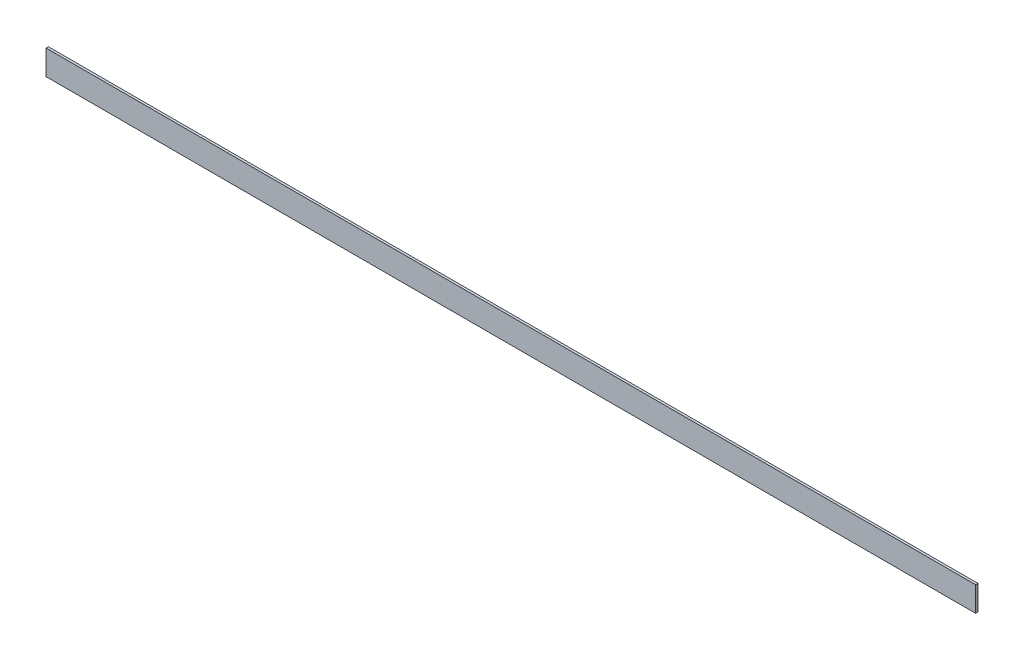
ISO-10303-21;
HEADER;
FILE_DESCRIPTION(('STEP AP214'),'2;1');
FILE_NAME('part.step','',(''),(''),'','','');
FILE_SCHEMA(('AUTOMOTIVE_DESIGN { 1 0 10303 214 1 1 1 1 }'));
ENDSEC;
DATA;
#1=APPLICATION_CONTEXT('core data for automotive mechanical design processes');
#2=APPLICATION_PROTOCOL_DEFINITION('international standard','automotive_design',2000,#1);
#3=PRODUCT_CONTEXT('',#1,'mechanical');
#4=PRODUCT('Part','Part','',(#3));
#5=PRODUCT_RELATED_PRODUCT_CATEGORY('part','',(#4));
#6=PRODUCT_DEFINITION_FORMATION('','',#4);
#7=PRODUCT_DEFINITION_CONTEXT('part definition',#1,'design');
#8=PRODUCT_DEFINITION('design','',#6,#7);
#9=PRODUCT_DEFINITION_SHAPE('','',#8);
#10=(LENGTH_UNIT() NAMED_UNIT(*) SI_UNIT(.MILLI.,.METRE.));
#11=(NAMED_UNIT(*) PLANE_ANGLE_UNIT() SI_UNIT($,.RADIAN.));
#12=(NAMED_UNIT(*) SI_UNIT($,.STERADIAN.) SOLID_ANGLE_UNIT());
#13=UNCERTAINTY_MEASURE_WITH_UNIT(LENGTH_MEASURE(1.E-05),#10,'distance_accuracy_value','');
#14=(GEOMETRIC_REPRESENTATION_CONTEXT(3) GLOBAL_UNCERTAINTY_ASSIGNED_CONTEXT((#13)) GLOBAL_UNIT_ASSIGNED_CONTEXT((#10,
#11,#12)) REPRESENTATION_CONTEXT('',''));
#15=CARTESIAN_POINT('',(0.,0.,0.));
#16=DIRECTION('',(0.,0.,1.));
#17=DIRECTION('',(1.,0.,0.));
#18=AXIS2_PLACEMENT_3D('',#15,#16,#17);
#19=CARTESIAN_POINT('',(0.,0.,0.75));
#20=DIRECTION('',(0.,0.,1.));
#21=DIRECTION('',(1.,0.,0.));
#22=AXIS2_PLACEMENT_3D('',#19,#20,#21);
#23=PLANE('',#22);
#24=DIRECTION('',(0.,1.,0.));
#25=VECTOR('',#24,1.);
#26=CARTESIAN_POINT('',(-150.,171.941489418563,0.75));
#27=LINE('',#26,#25);
#28=CARTESIAN_POINT('',(-150.,171.941489418563,0.75));
#29=VERTEX_POINT('',#28);
#30=CARTESIAN_POINT('',(-150.,163.941489418563,0.75));
#31=VERTEX_POINT('',#30);
#32=EDGE_CURVE('E55',#29,#31,#27,.F.);
#33=ORIENTED_EDGE('',*,*,#32,.T.);
#34=DIRECTION('',(1.,0.,0.));
#35=VECTOR('',#34,1.);
#36=CARTESIAN_POINT('',(-150.,163.941489418563,0.75));
#37=LINE('',#36,#35);
#38=CARTESIAN_POINT('',(150.,163.941489418563,0.75));
#39=VERTEX_POINT('',#38);
#40=EDGE_CURVE('E76',#31,#39,#37,.T.);
#41=ORIENTED_EDGE('',*,*,#40,.T.);
#42=DIRECTION('',(0.,1.,0.));
#43=VECTOR('',#42,1.);
#44=CARTESIAN_POINT('',(150.,171.941489418563,0.75));
#45=LINE('',#44,#43);
#46=CARTESIAN_POINT('',(150.,171.941489418563,0.75));
#47=VERTEX_POINT('',#46);
#48=EDGE_CURVE('E58',#39,#47,#45,.T.);
#49=ORIENTED_EDGE('',*,*,#48,.T.);
#50=DIRECTION('',(1.,0.,0.));
#51=VECTOR('',#50,1.);
#52=CARTESIAN_POINT('',(-150.,171.941489418563,0.75));
#53=LINE('',#52,#51);
#54=EDGE_CURVE('E20',#47,#29,#53,.F.);
#55=ORIENTED_EDGE('',*,*,#54,.T.);
#56=EDGE_LOOP('',(#33,#41,#49,#55));
#57=FACE_BOUND('',#56,.T.);
#58=ADVANCED_FACE('F17',(#57),#23,.T.);
#59=CARTESIAN_POINT('',(-150.,171.941489418563,0.75));
#60=DIRECTION('',(0.,-1.,0.));
#61=DIRECTION('',(0.,0.,-1.));
#62=AXIS2_PLACEMENT_3D('',#59,#60,#61);
#63=PLANE('',#62);
#64=DIRECTION('',(0.,0.,1.));
#65=VECTOR('',#64,1.);
#66=CARTESIAN_POINT('',(-150.,171.941489418563,0.75));
#67=LINE('',#66,#65);
#68=CARTESIAN_POINT('',(-150.,171.941489418563,0.));
#69=VERTEX_POINT('',#68);
#70=EDGE_CURVE('E63',#69,#29,#67,.T.);
#71=ORIENTED_EDGE('',*,*,#70,.T.);
#72=ORIENTED_EDGE('',*,*,#54,.F.);
#73=DIRECTION('',(0.,0.,1.));
#74=VECTOR('',#73,1.);
#75=CARTESIAN_POINT('',(150.,171.941489418563,0.75));
#76=LINE('',#75,#74);
#77=CARTESIAN_POINT('',(150.,171.941489418563,0.));
#78=VERTEX_POINT('',#77);
#79=EDGE_CURVE('E80',#47,#78,#76,.F.);
#80=ORIENTED_EDGE('',*,*,#79,.T.);
#81=DIRECTION('',(1.,0.,0.));
#82=VECTOR('',#81,1.);
#83=CARTESIAN_POINT('',(0.,171.941489418563,0.));
#84=LINE('',#83,#82);
#85=EDGE_CURVE('E73',#78,#69,#84,.F.);
#86=ORIENTED_EDGE('',*,*,#85,.T.);
#87=EDGE_LOOP('',(#71,#72,#80,#86));
#88=FACE_BOUND('',#87,.T.);
#89=ADVANCED_FACE('F72',(#88),#63,.F.);
#90=CARTESIAN_POINT('',(-150.,171.941489418563,0.75));
#91=DIRECTION('',(1.,0.,0.));
#92=DIRECTION('',(0.,1.,0.));
#93=AXIS2_PLACEMENT_3D('',#90,#91,#92);
#94=PLANE('',#93);
#95=DIRECTION('',(0.,0.,1.));
#96=VECTOR('',#95,1.);
#97=CARTESIAN_POINT('',(-150.,163.941489418563,0.75));
#98=LINE('',#97,#96);
#99=CARTESIAN_POINT('',(-150.,163.941489418563,0.));
#100=VERTEX_POINT('',#99);
#101=EDGE_CURVE('E69',#100,#31,#98,.T.);
#102=ORIENTED_EDGE('',*,*,#101,.T.);
#103=ORIENTED_EDGE('',*,*,#32,.F.);
#104=ORIENTED_EDGE('',*,*,#70,.F.);
#105=DIRECTION('',(0.,1.,0.));
#106=VECTOR('',#105,1.);
#107=CARTESIAN_POINT('',(-150.,0.,0.));
#108=LINE('',#107,#106);
#109=EDGE_CURVE('E83',#69,#100,#108,.F.);
#110=ORIENTED_EDGE('',*,*,#109,.T.);
#111=EDGE_LOOP('',(#102,#103,#104,#110));
#112=FACE_BOUND('',#111,.T.);
#113=ADVANCED_FACE('F66',(#112),#94,.F.);
#114=CARTESIAN_POINT('',(-150.,163.941489418563,0.75));
#115=DIRECTION('',(0.,1.,0.));
#116=DIRECTION('',(0.,0.,1.));
#117=AXIS2_PLACEMENT_3D('',#114,#115,#116);
#118=PLANE('',#117);
#119=DIRECTION('',(0.,0.,1.));
#120=VECTOR('',#119,1.);
#121=CARTESIAN_POINT('',(150.,163.941489418563,0.75));
#122=LINE('',#121,#120);
#123=CARTESIAN_POINT('',(150.,163.941489418563,0.));
#124=VERTEX_POINT('',#123);
#125=EDGE_CURVE('E34',#124,#39,#122,.T.);
#126=ORIENTED_EDGE('',*,*,#125,.T.);
#127=ORIENTED_EDGE('',*,*,#40,.F.);
#128=ORIENTED_EDGE('',*,*,#101,.F.);
#129=DIRECTION('',(1.,0.,0.));
#130=VECTOR('',#129,1.);
#131=CARTESIAN_POINT('',(0.,163.941489418563,0.));
#132=LINE('',#131,#130);
#133=EDGE_CURVE('E26',#100,#124,#132,.T.);
#134=ORIENTED_EDGE('',*,*,#133,.T.);
#135=EDGE_LOOP('',(#126,#127,#128,#134));
#136=FACE_BOUND('',#135,.T.);
#137=ADVANCED_FACE('F88',(#136),#118,.F.);
#138=CARTESIAN_POINT('',(150.,171.941489418563,0.75));
#139=DIRECTION('',(-1.,0.,0.));
#140=DIRECTION('',(0.,0.,1.));
#141=AXIS2_PLACEMENT_3D('',#138,#139,#140);
#142=PLANE('',#141);
#143=ORIENTED_EDGE('',*,*,#79,.F.);
#144=ORIENTED_EDGE('',*,*,#48,.F.);
#145=ORIENTED_EDGE('',*,*,#125,.F.);
#146=DIRECTION('',(0.,1.,0.));
#147=VECTOR('',#146,1.);
#148=CARTESIAN_POINT('',(150.,0.,0.));
#149=LINE('',#148,#147);
#150=EDGE_CURVE('E11',#124,#78,#149,.T.);
#151=ORIENTED_EDGE('',*,*,#150,.T.);
#152=EDGE_LOOP('',(#143,#144,#145,#151));
#153=FACE_BOUND('',#152,.T.);
#154=ADVANCED_FACE('F91',(#153),#142,.F.);
#155=CARTESIAN_POINT('',(0.,0.,0.));
#156=DIRECTION('',(0.,0.,1.));
#157=DIRECTION('',(1.,0.,0.));
#158=AXIS2_PLACEMENT_3D('',#155,#156,#157);
#159=PLANE('',#158);
#160=ORIENTED_EDGE('',*,*,#133,.F.);
#161=ORIENTED_EDGE('',*,*,#109,.F.);
#162=ORIENTED_EDGE('',*,*,#85,.F.);
#163=ORIENTED_EDGE('',*,*,#150,.F.);
#164=EDGE_LOOP('',(#160,#161,#162,#163));
#165=FACE_BOUND('',#164,.T.);
#166=ADVANCED_FACE('F90',(#165),#159,.F.);
#167=CLOSED_SHELL('',(#58,#89,#113,#137,#154,#166));
#168=MANIFOLD_SOLID_BREP('B1',#167);
#169=ADVANCED_BREP_SHAPE_REPRESENTATION('',(#18,#168),#14);
#170=SHAPE_DEFINITION_REPRESENTATION(#9,#169);
ENDSEC;
END-ISO-10303-21;
